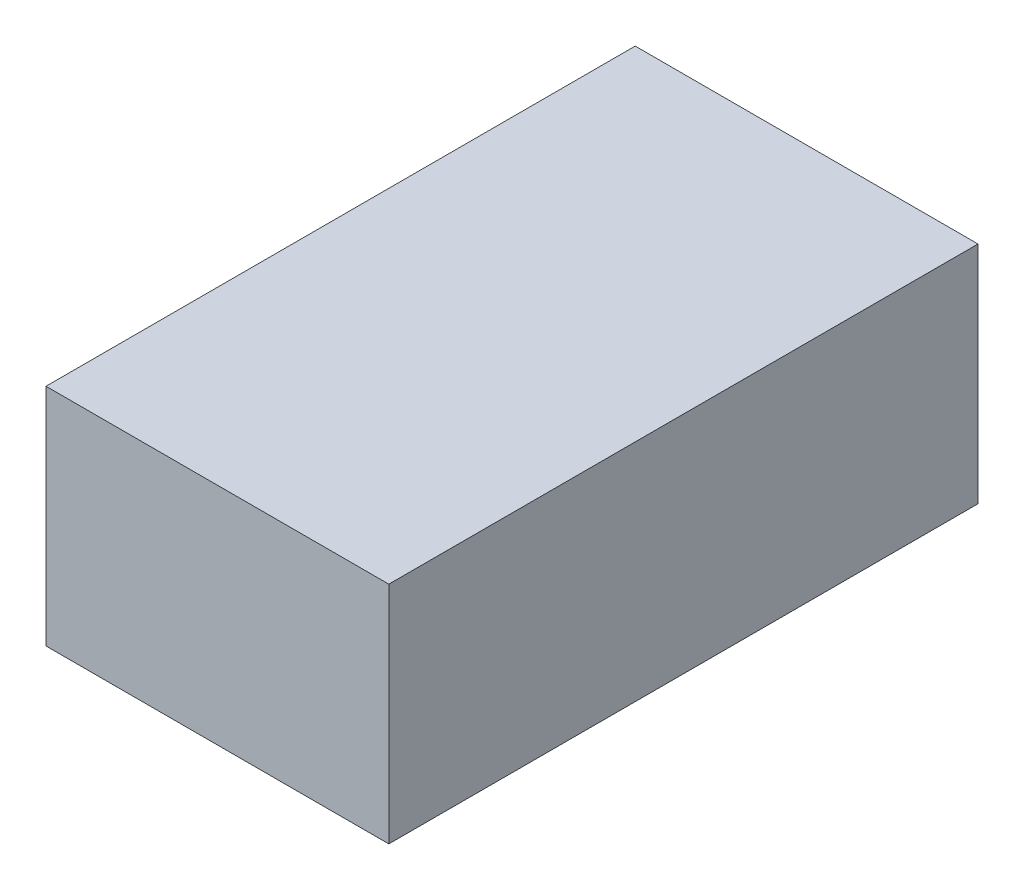
ISO-10303-21;
HEADER;
FILE_DESCRIPTION(('STEP AP214'),'2;1');
FILE_NAME('part.step','',(''),(''),'','','');
FILE_SCHEMA(('AUTOMOTIVE_DESIGN { 1 0 10303 214 1 1 1 1 }'));
ENDSEC;
DATA;
#1=APPLICATION_CONTEXT('core data for automotive mechanical design processes');
#2=APPLICATION_PROTOCOL_DEFINITION('international standard','automotive_design',2000,#1);
#3=PRODUCT_CONTEXT('',#1,'mechanical');
#4=PRODUCT('Part','Part','',(#3));
#5=PRODUCT_RELATED_PRODUCT_CATEGORY('part','',(#4));
#6=PRODUCT_DEFINITION_FORMATION('','',#4);
#7=PRODUCT_DEFINITION_CONTEXT('part definition',#1,'design');
#8=PRODUCT_DEFINITION('design','',#6,#7);
#9=PRODUCT_DEFINITION_SHAPE('','',#8);
#10=(LENGTH_UNIT() NAMED_UNIT(*) SI_UNIT(.MILLI.,.METRE.));
#11=(NAMED_UNIT(*) PLANE_ANGLE_UNIT() SI_UNIT($,.RADIAN.));
#12=(NAMED_UNIT(*) SI_UNIT($,.STERADIAN.) SOLID_ANGLE_UNIT());
#13=UNCERTAINTY_MEASURE_WITH_UNIT(LENGTH_MEASURE(1.E-05),#10,'distance_accuracy_value','');
#14=(GEOMETRIC_REPRESENTATION_CONTEXT(3) GLOBAL_UNCERTAINTY_ASSIGNED_CONTEXT((#13)) GLOBAL_UNIT_ASSIGNED_CONTEXT((#10,
#11,#12)) REPRESENTATION_CONTEXT('',''));
#15=CARTESIAN_POINT('',(0.,0.,0.));
#16=DIRECTION('',(0.,0.,1.));
#17=DIRECTION('',(1.,0.,0.));
#18=AXIS2_PLACEMENT_3D('',#15,#16,#17);
#19=CARTESIAN_POINT('',(16.,21.,27.5));
#20=DIRECTION('',(-1.,0.,0.));
#21=DIRECTION('',(0.,0.,1.));
#22=AXIS2_PLACEMENT_3D('',#19,#20,#21);
#23=PLANE('',#22);
#24=DIRECTION('',(0.,0.,-1.));
#25=VECTOR('',#24,1.);
#26=CARTESIAN_POINT('',(16.,0.,27.5));
#27=LINE('',#26,#25);
#28=CARTESIAN_POINT('',(16.,0.,27.5));
#29=VERTEX_POINT('',#28);
#30=CARTESIAN_POINT('',(16.,0.,-27.5));
#31=VERTEX_POINT('',#30);
#32=EDGE_CURVE('E96',#29,#31,#27,.T.);
#33=ORIENTED_EDGE('',*,*,#32,.T.);
#34=DIRECTION('',(0.,-1.,0.));
#35=VECTOR('',#34,1.);
#36=CARTESIAN_POINT('',(16.,21.,-27.5));
#37=LINE('',#36,#35);
#38=CARTESIAN_POINT('',(16.,21.,-27.5));
#39=VERTEX_POINT('',#38);
#40=EDGE_CURVE('E11',#39,#31,#37,.T.);
#41=ORIENTED_EDGE('',*,*,#40,.F.);
#42=DIRECTION('',(0.,0.,-1.));
#43=VECTOR('',#42,1.);
#44=CARTESIAN_POINT('',(16.,21.,27.5));
#45=LINE('',#44,#43);
#46=CARTESIAN_POINT('',(16.,21.,27.5));
#47=VERTEX_POINT('',#46);
#48=EDGE_CURVE('E84',#47,#39,#45,.T.);
#49=ORIENTED_EDGE('',*,*,#48,.F.);
#50=DIRECTION('',(0.,-1.,0.));
#51=VECTOR('',#50,1.);
#52=CARTESIAN_POINT('',(16.,21.,27.5));
#53=LINE('',#52,#51);
#54=EDGE_CURVE('E92',#47,#29,#53,.T.);
#55=ORIENTED_EDGE('',*,*,#54,.T.);
#56=EDGE_LOOP('',(#33,#41,#49,#55));
#57=FACE_BOUND('',#56,.T.);
#58=ADVANCED_FACE('F33',(#57),#23,.F.);
#59=CARTESIAN_POINT('',(-16.,21.,-27.5));
#60=DIRECTION('',(0.,0.,1.));
#61=DIRECTION('',(1.,0.,0.));
#62=AXIS2_PLACEMENT_3D('',#59,#60,#61);
#63=PLANE('',#62);
#64=DIRECTION('',(-1.,0.,0.));
#65=VECTOR('',#64,1.);
#66=CARTESIAN_POINT('',(-16.,0.,-27.5));
#67=LINE('',#66,#65);
#68=CARTESIAN_POINT('',(-16.,0.,-27.5));
#69=VERTEX_POINT('',#68);
#70=EDGE_CURVE('E88',#31,#69,#67,.T.);
#71=ORIENTED_EDGE('',*,*,#70,.T.);
#72=DIRECTION('',(0.,-1.,0.));
#73=VECTOR('',#72,1.);
#74=CARTESIAN_POINT('',(-16.,21.,-27.5));
#75=LINE('',#74,#73);
#76=CARTESIAN_POINT('',(-16.,21.,-27.5));
#77=VERTEX_POINT('',#76);
#78=EDGE_CURVE('E41',#77,#69,#75,.T.);
#79=ORIENTED_EDGE('',*,*,#78,.F.);
#80=DIRECTION('',(-1.,0.,0.));
#81=VECTOR('',#80,1.);
#82=CARTESIAN_POINT('',(-16.,21.,-27.5));
#83=LINE('',#82,#81);
#84=EDGE_CURVE('E79',#39,#77,#83,.T.);
#85=ORIENTED_EDGE('',*,*,#84,.F.);
#86=ORIENTED_EDGE('',*,*,#40,.T.);
#87=EDGE_LOOP('',(#71,#79,#85,#86));
#88=FACE_BOUND('',#87,.T.);
#89=ADVANCED_FACE('F87',(#88),#63,.F.);
#90=CARTESIAN_POINT('',(-16.,21.,27.5));
#91=DIRECTION('',(1.,0.,0.));
#92=DIRECTION('',(0.,0.,-1.));
#93=AXIS2_PLACEMENT_3D('',#90,#91,#92);
#94=PLANE('',#93);
#95=DIRECTION('',(0.,0.,1.));
#96=VECTOR('',#95,1.);
#97=CARTESIAN_POINT('',(-16.,0.,27.5));
#98=LINE('',#97,#96);
#99=CARTESIAN_POINT('',(-16.,0.,27.5));
#100=VERTEX_POINT('',#99);
#101=EDGE_CURVE('E66',#69,#100,#98,.T.);
#102=ORIENTED_EDGE('',*,*,#101,.T.);
#103=DIRECTION('',(0.,-1.,0.));
#104=VECTOR('',#103,1.);
#105=CARTESIAN_POINT('',(-16.,21.,27.5));
#106=LINE('',#105,#104);
#107=CARTESIAN_POINT('',(-16.,21.,27.5));
#108=VERTEX_POINT('',#107);
#109=EDGE_CURVE('E89',#108,#100,#106,.T.);
#110=ORIENTED_EDGE('',*,*,#109,.F.);
#111=DIRECTION('',(0.,0.,1.));
#112=VECTOR('',#111,1.);
#113=CARTESIAN_POINT('',(-16.,21.,27.5));
#114=LINE('',#113,#112);
#115=EDGE_CURVE('E82',#77,#108,#114,.T.);
#116=ORIENTED_EDGE('',*,*,#115,.F.);
#117=ORIENTED_EDGE('',*,*,#78,.T.);
#118=EDGE_LOOP('',(#102,#110,#116,#117));
#119=FACE_BOUND('',#118,.T.);
#120=ADVANCED_FACE('F90',(#119),#94,.F.);
#121=CARTESIAN_POINT('',(-16.,21.,27.5));
#122=DIRECTION('',(0.,0.,-1.));
#123=DIRECTION('',(-1.,0.,0.));
#124=AXIS2_PLACEMENT_3D('',#121,#122,#123);
#125=PLANE('',#124);
#126=DIRECTION('',(1.,0.,0.));
#127=VECTOR('',#126,1.);
#128=CARTESIAN_POINT('',(-16.,0.,27.5));
#129=LINE('',#128,#127);
#130=EDGE_CURVE('E72',#100,#29,#129,.T.);
#131=ORIENTED_EDGE('',*,*,#130,.T.);
#132=ORIENTED_EDGE('',*,*,#54,.F.);
#133=DIRECTION('',(1.,0.,0.));
#134=VECTOR('',#133,1.);
#135=CARTESIAN_POINT('',(-16.,21.,27.5));
#136=LINE('',#135,#134);
#137=EDGE_CURVE('E49',#108,#47,#136,.T.);
#138=ORIENTED_EDGE('',*,*,#137,.F.);
#139=ORIENTED_EDGE('',*,*,#109,.T.);
#140=EDGE_LOOP('',(#131,#132,#138,#139));
#141=FACE_BOUND('',#140,.T.);
#142=ADVANCED_FACE('F103',(#141),#125,.F.);
#143=CARTESIAN_POINT('',(0.,21.,0.));
#144=DIRECTION('',(0.,-1.,0.));
#145=DIRECTION('',(0.,0.,-1.));
#146=AXIS2_PLACEMENT_3D('',#143,#144,#145);
#147=PLANE('',#146);
#148=ORIENTED_EDGE('',*,*,#48,.T.);
#149=ORIENTED_EDGE('',*,*,#84,.T.);
#150=ORIENTED_EDGE('',*,*,#115,.T.);
#151=ORIENTED_EDGE('',*,*,#137,.T.);
#152=EDGE_LOOP('',(#148,#149,#150,#151));
#153=FACE_BOUND('',#152,.T.);
#154=ADVANCED_FACE('F80',(#153),#147,.F.);
#155=CARTESIAN_POINT('',(0.,0.,0.));
#156=DIRECTION('',(0.,-1.,0.));
#157=DIRECTION('',(0.,0.,-1.));
#158=AXIS2_PLACEMENT_3D('',#155,#156,#157);
#159=PLANE('',#158);
#160=ORIENTED_EDGE('',*,*,#32,.F.);
#161=ORIENTED_EDGE('',*,*,#130,.F.);
#162=ORIENTED_EDGE('',*,*,#101,.F.);
#163=ORIENTED_EDGE('',*,*,#70,.F.);
#164=EDGE_LOOP('',(#160,#161,#162,#163));
#165=FACE_BOUND('',#164,.T.);
#166=ADVANCED_FACE('F106',(#165),#159,.T.);
#167=CLOSED_SHELL('',(#58,#89,#120,#142,#154,#166));
#168=MANIFOLD_SOLID_BREP('B2',#167);
#169=ADVANCED_BREP_SHAPE_REPRESENTATION('',(#18,#168),#14);
#170=SHAPE_DEFINITION_REPRESENTATION(#9,#169);
ENDSEC;
END-ISO-10303-21;
